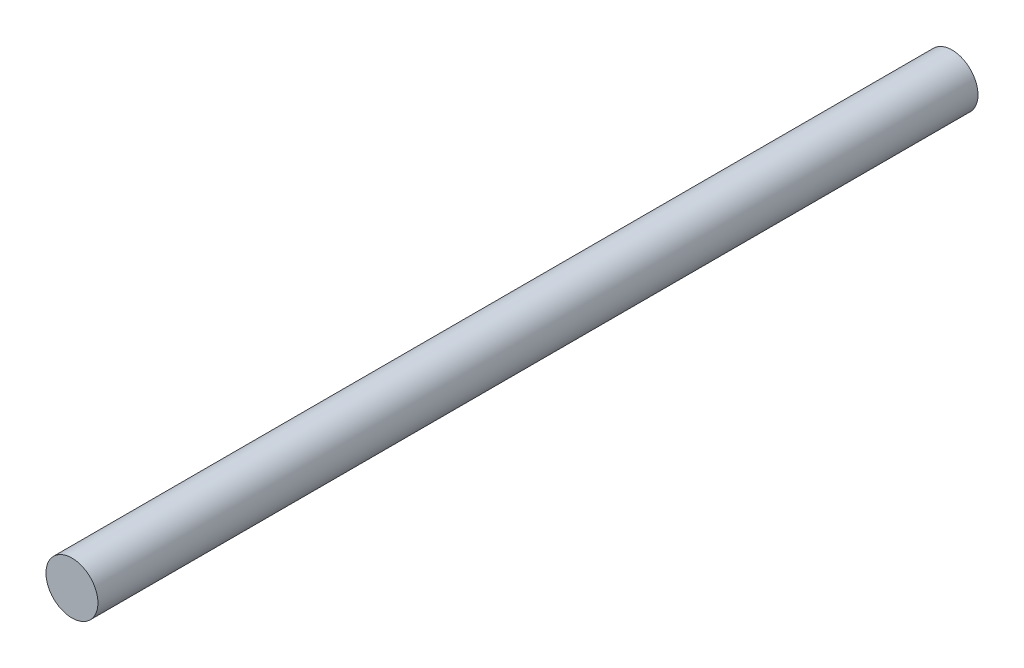
ISO-10303-21;
HEADER;
FILE_DESCRIPTION(('STEP AP214'),'2;1');
FILE_NAME('part.step','',(''),(''),'','','');
FILE_SCHEMA(('AUTOMOTIVE_DESIGN { 1 0 10303 214 1 1 1 1 }'));
ENDSEC;
DATA;
#1=APPLICATION_CONTEXT('core data for automotive mechanical design processes');
#2=APPLICATION_PROTOCOL_DEFINITION('international standard','automotive_design',2000,#1);
#3=PRODUCT_CONTEXT('',#1,'mechanical');
#4=PRODUCT('Part','Part','',(#3));
#5=PRODUCT_RELATED_PRODUCT_CATEGORY('part','',(#4));
#6=PRODUCT_DEFINITION_FORMATION('','',#4);
#7=PRODUCT_DEFINITION_CONTEXT('part definition',#1,'design');
#8=PRODUCT_DEFINITION('design','',#6,#7);
#9=PRODUCT_DEFINITION_SHAPE('','',#8);
#10=(LENGTH_UNIT() NAMED_UNIT(*) SI_UNIT(.MILLI.,.METRE.));
#11=(NAMED_UNIT(*) PLANE_ANGLE_UNIT() SI_UNIT($,.RADIAN.));
#12=(NAMED_UNIT(*) SI_UNIT($,.STERADIAN.) SOLID_ANGLE_UNIT());
#13=UNCERTAINTY_MEASURE_WITH_UNIT(LENGTH_MEASURE(1.E-05),#10,'distance_accuracy_value','');
#14=(GEOMETRIC_REPRESENTATION_CONTEXT(3) GLOBAL_UNCERTAINTY_ASSIGNED_CONTEXT((#13)) GLOBAL_UNIT_ASSIGNED_CONTEXT((#10,
#11,#12)) REPRESENTATION_CONTEXT('',''));
#15=CARTESIAN_POINT('',(0.,0.,0.));
#16=DIRECTION('',(0.,0.,1.));
#17=DIRECTION('',(1.,0.,0.));
#18=AXIS2_PLACEMENT_3D('',#15,#16,#17);
#19=CARTESIAN_POINT('',(0.,0.,101.6));
#20=DIRECTION('',(0.,0.,-1.));
#21=DIRECTION('',(-1.,0.,0.));
#22=AXIS2_PLACEMENT_3D('',#19,#20,#21);
#23=CYLINDRICAL_SURFACE('',#22,3.);
#24=CARTESIAN_POINT('',(0.,0.,101.6));
#25=DIRECTION('',(0.,0.,1.));
#26=DIRECTION('',(1.,0.,0.));
#27=AXIS2_PLACEMENT_3D('',#24,#25,#26);
#28=CIRCLE('',#27,3.);
#29=CARTESIAN_POINT('',(3.,0.,101.6));
#30=VERTEX_POINT('',#29);
#31=EDGE_CURVE('E10',#30,#30,#28,.T.);
#32=ORIENTED_EDGE('',*,*,#31,.F.);
#33=EDGE_LOOP('',(#32));
#34=FACE_BOUND('',#33,.T.);
#35=CARTESIAN_POINT('',(0.,0.,0.));
#36=DIRECTION('',(0.,0.,1.));
#37=DIRECTION('',(1.,0.,0.));
#38=AXIS2_PLACEMENT_3D('',#35,#36,#37);
#39=CIRCLE('',#38,3.);
#40=CARTESIAN_POINT('',(3.,0.,0.));
#41=VERTEX_POINT('',#40);
#42=EDGE_CURVE('E44',#41,#41,#39,.T.);
#43=ORIENTED_EDGE('',*,*,#42,.T.);
#44=EDGE_LOOP('',(#43));
#45=FACE_BOUND('',#44,.T.);
#46=ADVANCED_FACE('F41',(#34,#45),#23,.T.);
#47=CARTESIAN_POINT('',(0.,0.,101.6));
#48=DIRECTION('',(0.,0.,1.));
#49=DIRECTION('',(1.,0.,0.));
#50=AXIS2_PLACEMENT_3D('',#47,#48,#49);
#51=PLANE('',#50);
#52=ORIENTED_EDGE('',*,*,#31,.T.);
#53=EDGE_LOOP('',(#52));
#54=FACE_BOUND('',#53,.T.);
#55=ADVANCED_FACE('F58',(#54),#51,.T.);
#56=CARTESIAN_POINT('',(0.,0.,0.));
#57=DIRECTION('',(0.,0.,1.));
#58=DIRECTION('',(1.,0.,0.));
#59=AXIS2_PLACEMENT_3D('',#56,#57,#58);
#60=PLANE('',#59);
#61=ORIENTED_EDGE('',*,*,#42,.F.);
#62=EDGE_LOOP('',(#61));
#63=FACE_BOUND('',#62,.T.);
#64=ADVANCED_FACE('F56',(#63),#60,.F.);
#65=CLOSED_SHELL('',(#46,#55,#64));
#66=MANIFOLD_SOLID_BREP('B2',#65);
#67=ADVANCED_BREP_SHAPE_REPRESENTATION('',(#18,#66),#14);
#68=SHAPE_DEFINITION_REPRESENTATION(#9,#67);
ENDSEC;
END-ISO-10303-21;
